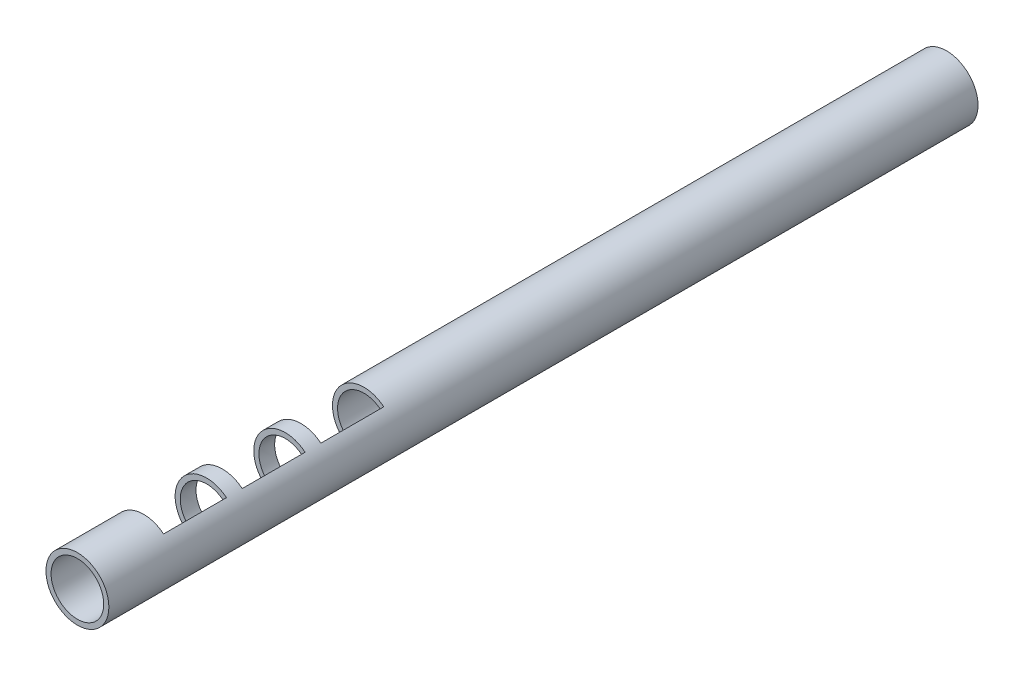
ISO-10303-21;
HEADER;
FILE_DESCRIPTION(('STEP AP214'),'2;1');
FILE_NAME('part.step','',(''),(''),'','','');
FILE_SCHEMA(('AUTOMOTIVE_DESIGN { 1 0 10303 214 1 1 1 1 }'));
ENDSEC;
DATA;
#1=APPLICATION_CONTEXT('core data for automotive mechanical design processes');
#2=APPLICATION_PROTOCOL_DEFINITION('international standard','automotive_design',2000,#1);
#3=PRODUCT_CONTEXT('',#1,'mechanical');
#4=PRODUCT('Part','Part','',(#3));
#5=PRODUCT_RELATED_PRODUCT_CATEGORY('part','',(#4));
#6=PRODUCT_DEFINITION_FORMATION('','',#4);
#7=PRODUCT_DEFINITION_CONTEXT('part definition',#1,'design');
#8=PRODUCT_DEFINITION('design','',#6,#7);
#9=PRODUCT_DEFINITION_SHAPE('','',#8);
#10=(LENGTH_UNIT() NAMED_UNIT(*) SI_UNIT(.MILLI.,.METRE.));
#11=(NAMED_UNIT(*) PLANE_ANGLE_UNIT() SI_UNIT($,.RADIAN.));
#12=(NAMED_UNIT(*) SI_UNIT($,.STERADIAN.) SOLID_ANGLE_UNIT());
#13=UNCERTAINTY_MEASURE_WITH_UNIT(LENGTH_MEASURE(1.E-05),#10,'distance_accuracy_value','');
#14=(GEOMETRIC_REPRESENTATION_CONTEXT(3) GLOBAL_UNCERTAINTY_ASSIGNED_CONTEXT((#13)) GLOBAL_UNIT_ASSIGNED_CONTEXT((#10,
#11,#12)) REPRESENTATION_CONTEXT('',''));
#15=CARTESIAN_POINT('',(0.,0.,0.));
#16=DIRECTION('',(0.,0.,1.));
#17=DIRECTION('',(1.,0.,0.));
#18=AXIS2_PLACEMENT_3D('',#15,#16,#17);
#19=CARTESIAN_POINT('',(0.393200000000001,0.481952030808046,2.488));
#20=DIRECTION('',(-0.774842493260524,0.632154340836013,0.));
#21=DIRECTION('',(0.,0.,1.));
#22=AXIS2_PLACEMENT_3D('',#19,#20,#21);
#23=PLANE('',#22);
#24=DIRECTION('',(0.632154340836013,0.774842493260524,0.));
#25=VECTOR('',#24,1.);
#26=CARTESIAN_POINT('',(0.393200000000001,0.481952030808046,1.866));
#27=LINE('',#26,#25);
#28=CARTESIAN_POINT('',(0.329108400000001,0.403393849786335,1.866));
#29=VERTEX_POINT('',#28);
#30=CARTESIAN_POINT('',(0.393200000000001,0.481952030808046,1.866));
#31=VERTEX_POINT('',#30);
#32=EDGE_CURVE('E11',#29,#31,#27,.T.);
#33=ORIENTED_EDGE('',*,*,#32,.F.);
#34=DIRECTION('',(0.,0.,1.));
#35=VECTOR('',#34,1.);
#36=CARTESIAN_POINT('',(0.329108400000001,0.403393849786335,1.555));
#37=LINE('',#36,#35);
#38=CARTESIAN_POINT('',(0.329108400000001,0.403393849786335,3.11));
#39=VERTEX_POINT('',#38);
#40=EDGE_CURVE('E291',#29,#39,#37,.T.);
#41=ORIENTED_EDGE('',*,*,#40,.T.);
#42=DIRECTION('',(0.632154340836013,0.774842493260524,0.));
#43=VECTOR('',#42,1.);
#44=CARTESIAN_POINT('',(0.393200000000001,0.481952030808046,3.11));
#45=LINE('',#44,#43);
#46=CARTESIAN_POINT('',(0.393200000000001,0.481952030808046,3.11));
#47=VERTEX_POINT('',#46);
#48=EDGE_CURVE('E46',#39,#47,#45,.T.);
#49=ORIENTED_EDGE('',*,*,#48,.T.);
#50=DIRECTION('',(0.,0.,1.));
#51=VECTOR('',#50,1.);
#52=CARTESIAN_POINT('',(0.393200000000001,0.481952030808046,1.555));
#53=LINE('',#52,#51);
#54=EDGE_CURVE('E281',#31,#47,#53,.T.);
#55=ORIENTED_EDGE('',*,*,#54,.F.);
#56=EDGE_LOOP('',(#33,#41,#49,#55));
#57=FACE_BOUND('',#56,.T.);
#58=ADVANCED_FACE('F38',(#57),#23,.T.);
#59=CARTESIAN_POINT('',(0.,0.,3.11));
#60=DIRECTION('',(0.,0.,1.));
#61=DIRECTION('',(1.,0.,0.));
#62=AXIS2_PLACEMENT_3D('',#59,#60,#61);
#63=PLANE('',#62);
#64=ORIENTED_EDGE('',*,*,#48,.F.);
#65=CARTESIAN_POINT('',(0.,0.,3.11));
#66=DIRECTION('',(0.,0.,1.));
#67=DIRECTION('',(1.,0.,0.));
#68=AXIS2_PLACEMENT_3D('',#65,#66,#67);
#69=CIRCLE('',#68,0.520614);
#70=CARTESIAN_POINT('',(0.329108400000001,-0.403393849786335,3.11));
#71=VERTEX_POINT('',#70);
#72=EDGE_CURVE('E288',#39,#71,#69,.T.);
#73=ORIENTED_EDGE('',*,*,#72,.T.);
#74=DIRECTION('',(0.632154340836013,-0.774842493260524,0.));
#75=VECTOR('',#74,1.);
#76=CARTESIAN_POINT('',(0.3932,-0.481952030808046,3.11));
#77=LINE('',#76,#75);
#78=CARTESIAN_POINT('',(0.3932,-0.481952030808046,3.11));
#79=VERTEX_POINT('',#78);
#80=EDGE_CURVE('E171',#71,#79,#77,.T.);
#81=ORIENTED_EDGE('',*,*,#80,.T.);
#82=CARTESIAN_POINT('',(0.,0.,3.11));
#83=DIRECTION('',(0.,0.,-1.));
#84=DIRECTION('',(-1.,0.,0.));
#85=AXIS2_PLACEMENT_3D('',#82,#83,#84);
#86=CIRCLE('',#85,0.622);
#87=EDGE_CURVE('E276',#47,#79,#86,.F.);
#88=ORIENTED_EDGE('',*,*,#87,.F.);
#89=EDGE_LOOP('',(#64,#73,#81,#88));
#90=FACE_BOUND('',#89,.T.);
#91=ADVANCED_FACE('F236',(#90),#63,.F.);
#92=CARTESIAN_POINT('',(0.,0.,3.421));
#93=DIRECTION('',(0.,0.,-1.));
#94=DIRECTION('',(-1.,0.,0.));
#95=AXIS2_PLACEMENT_3D('',#92,#93,#94);
#96=PLANE('',#95);
#97=DIRECTION('',(0.632154340836013,0.774842493260524,0.));
#98=VECTOR('',#97,1.);
#99=CARTESIAN_POINT('',(0.393200000000001,0.481952030808046,3.421));
#100=LINE('',#99,#98);
#101=CARTESIAN_POINT('',(0.329108400000001,0.403393849786335,3.421));
#102=VERTEX_POINT('',#101);
#103=CARTESIAN_POINT('',(0.393200000000001,0.481952030808046,3.421));
#104=VERTEX_POINT('',#103);
#105=EDGE_CURVE('E263',#102,#104,#100,.T.);
#106=ORIENTED_EDGE('',*,*,#105,.T.);
#107=CARTESIAN_POINT('',(0.,0.,3.421));
#108=DIRECTION('',(0.,0.,1.));
#109=DIRECTION('',(1.,0.,0.));
#110=AXIS2_PLACEMENT_3D('',#107,#108,#109);
#111=CIRCLE('',#110,0.622);
#112=CARTESIAN_POINT('',(0.393200000000001,-0.481952030808046,3.421));
#113=VERTEX_POINT('',#112);
#114=EDGE_CURVE('E277',#104,#113,#111,.T.);
#115=ORIENTED_EDGE('',*,*,#114,.T.);
#116=DIRECTION('',(0.632154340836013,-0.774842493260524,0.));
#117=VECTOR('',#116,1.);
#118=CARTESIAN_POINT('',(0.393200000000001,-0.481952030808046,3.421));
#119=LINE('',#118,#117);
#120=CARTESIAN_POINT('',(0.329108400000001,-0.403393849786335,3.421));
#121=VERTEX_POINT('',#120);
#122=EDGE_CURVE('E147',#121,#113,#119,.T.);
#123=ORIENTED_EDGE('',*,*,#122,.F.);
#124=CARTESIAN_POINT('',(0.,0.,3.421));
#125=DIRECTION('',(0.,0.,1.));
#126=DIRECTION('',(1.,0.,0.));
#127=AXIS2_PLACEMENT_3D('',#124,#125,#126);
#128=CIRCLE('',#127,0.520614);
#129=EDGE_CURVE('E274',#102,#121,#128,.T.);
#130=ORIENTED_EDGE('',*,*,#129,.F.);
#131=EDGE_LOOP('',(#106,#115,#123,#130));
#132=FACE_BOUND('',#131,.T.);
#133=ADVANCED_FACE('F241',(#132),#96,.F.);
#134=CARTESIAN_POINT('',(0.,0.,1.555));
#135=DIRECTION('',(0.,0.,-1.));
#136=DIRECTION('',(-1.,0.,0.));
#137=AXIS2_PLACEMENT_3D('',#134,#135,#136);
#138=PLANE('',#137);
#139=DIRECTION('',(0.632154340836013,0.774842493260524,0.));
#140=VECTOR('',#139,1.);
#141=CARTESIAN_POINT('',(0.3932,0.481952030808046,1.555));
#142=LINE('',#141,#140);
#143=CARTESIAN_POINT('',(0.3291084,0.403393849786335,1.555));
#144=VERTEX_POINT('',#143);
#145=CARTESIAN_POINT('',(0.3932,0.481952030808046,1.555));
#146=VERTEX_POINT('',#145);
#147=EDGE_CURVE('E250',#144,#146,#142,.T.);
#148=ORIENTED_EDGE('',*,*,#147,.F.);
#149=CARTESIAN_POINT('',(0.,0.,1.555));
#150=DIRECTION('',(0.,0.,1.));
#151=DIRECTION('',(1.,0.,0.));
#152=AXIS2_PLACEMENT_3D('',#149,#150,#151);
#153=CIRCLE('',#152,0.520614);
#154=CARTESIAN_POINT('',(0.3291084,-0.403393849786335,1.555));
#155=VERTEX_POINT('',#154);
#156=EDGE_CURVE('E252',#144,#155,#153,.T.);
#157=ORIENTED_EDGE('',*,*,#156,.T.);
#158=DIRECTION('',(0.632154340836013,-0.774842493260524,0.));
#159=VECTOR('',#158,1.);
#160=CARTESIAN_POINT('',(0.3932,-0.481952030808046,1.555));
#161=LINE('',#160,#159);
#162=CARTESIAN_POINT('',(0.3932,-0.481952030808046,1.555));
#163=VERTEX_POINT('',#162);
#164=EDGE_CURVE('E160',#155,#163,#161,.T.);
#165=ORIENTED_EDGE('',*,*,#164,.T.);
#166=CARTESIAN_POINT('',(0.,0.,1.555));
#167=DIRECTION('',(0.,0.,1.));
#168=DIRECTION('',(1.,0.,0.));
#169=AXIS2_PLACEMENT_3D('',#166,#167,#168);
#170=CIRCLE('',#169,0.622);
#171=EDGE_CURVE('E61',#146,#163,#170,.T.);
#172=ORIENTED_EDGE('',*,*,#171,.F.);
#173=EDGE_LOOP('',(#148,#157,#165,#172));
#174=FACE_BOUND('',#173,.T.);
#175=ADVANCED_FACE('F232',(#174),#138,.T.);
#176=CARTESIAN_POINT('',(0.,0.,1.866));
#177=DIRECTION('',(0.,0.,-1.));
#178=DIRECTION('',(-1.,0.,0.));
#179=AXIS2_PLACEMENT_3D('',#176,#177,#178);
#180=PLANE('',#179);
#181=CARTESIAN_POINT('',(0.,0.,1.866));
#182=DIRECTION('',(0.,0.,1.));
#183=DIRECTION('',(1.,0.,0.));
#184=AXIS2_PLACEMENT_3D('',#181,#182,#183);
#185=CIRCLE('',#184,0.520614);
#186=CARTESIAN_POINT('',(0.329108400000001,-0.403393849786335,1.866));
#187=VERTEX_POINT('',#186);
#188=EDGE_CURVE('E279',#187,#29,#185,.F.);
#189=ORIENTED_EDGE('',*,*,#188,.T.);
#190=ORIENTED_EDGE('',*,*,#32,.T.);
#191=CARTESIAN_POINT('',(0.,0.,1.866));
#192=DIRECTION('',(0.,0.,1.));
#193=DIRECTION('',(1.,0.,0.));
#194=AXIS2_PLACEMENT_3D('',#191,#192,#193);
#195=CIRCLE('',#194,0.622);
#196=CARTESIAN_POINT('',(0.3932,-0.481952030808046,1.866));
#197=VERTEX_POINT('',#196);
#198=EDGE_CURVE('E284',#197,#31,#195,.F.);
#199=ORIENTED_EDGE('',*,*,#198,.F.);
#200=DIRECTION('',(0.632154340836013,-0.774842493260524,0.));
#201=VECTOR('',#200,1.);
#202=CARTESIAN_POINT('',(0.3932,-0.481952030808046,1.866));
#203=LINE('',#202,#201);
#204=EDGE_CURVE('E176',#187,#197,#203,.T.);
#205=ORIENTED_EDGE('',*,*,#204,.F.);
#206=EDGE_LOOP('',(#189,#190,#199,#205));
#207=FACE_BOUND('',#206,.T.);
#208=ADVANCED_FACE('F40',(#207),#180,.F.);
#209=CARTESIAN_POINT('',(0.,0.,1.555));
#210=DIRECTION('',(0.,0.,1.));
#211=DIRECTION('',(1.,0.,0.));
#212=AXIS2_PLACEMENT_3D('',#209,#210,#211);
#213=CYLINDRICAL_SURFACE('',#212,0.622);
#214=CARTESIAN_POINT('',(-0.622,0.,5.365));
#215=CARTESIAN_POINT('',(-0.621999577929827,0.0109193633288384,5.36499939308507));
#216=CARTESIAN_POINT('',(-0.621709329938002,0.0218502270294628,5.36410161503432));
#217=CARTESIAN_POINT('',(-0.620578112855119,0.043402443202015,5.36054010866013));
#218=CARTESIAN_POINT('',(-0.619736207669612,0.0540232374685384,5.35787337854731));
#219=CARTESIAN_POINT('',(-0.617593869971351,0.0746246518911457,5.35087419082279));
#220=CARTESIAN_POINT('',(-0.61629445041236,0.0846066291781811,5.34654541114978));
#221=CARTESIAN_POINT('',(-0.613370888019472,0.103699386181399,5.33635803819557));
#222=CARTESIAN_POINT('',(-0.61174679129765,0.112810289340036,5.33049966211826));
#223=CARTESIAN_POINT('',(-0.608286102372987,0.130203719158426,5.31721765206123));
#224=CARTESIAN_POINT('',(-0.606444663928166,0.138453985198494,5.30975303528527));
#225=CARTESIAN_POINT('',(-0.602784240920798,0.153610144329198,5.29355730894605));
#226=CARTESIAN_POINT('',(-0.600965262165017,0.160515696300347,5.28482587900247));
#227=CARTESIAN_POINT('',(-0.597503530771228,0.172963818804697,5.26606209326497));
#228=CARTESIAN_POINT('',(-0.595866696764658,0.178465603211153,5.25600148309368));
#229=CARTESIAN_POINT('',(-0.59302745289626,0.187685596399211,5.23503670826931));
#230=CARTESIAN_POINT('',(-0.591824918677886,0.191404315840203,5.22413278617599));
#231=CARTESIAN_POINT('',(-0.590041030843826,0.196833859126492,5.20215455937567));
#232=CARTESIAN_POINT('',(-0.589441214579351,0.198604530142794,5.19109658086054));
#233=CARTESIAN_POINT('',(-0.588875945894283,0.200274737992444,5.16882547613999));
#234=CARTESIAN_POINT('',(-0.588910313539342,0.200174805564169,5.15761239484344));
#235=CARTESIAN_POINT('',(-0.589593281584499,0.198153311328795,5.13585096574481));
#236=CARTESIAN_POINT('',(-0.590215937903085,0.196308688318,5.12529451770902));
#237=CARTESIAN_POINT('',(-0.591963052928186,0.190975230611652,5.10464966713253));
#238=CARTESIAN_POINT('',(-0.593087570309906,0.187486203657547,5.09456131947219));
#239=CARTESIAN_POINT('',(-0.595731017518543,0.178910257031213,5.07495920845102));
#240=CARTESIAN_POINT('',(-0.597255714099061,0.173799725062295,5.06545658672679));
#241=CARTESIAN_POINT('',(-0.600525069528976,0.162142523518303,5.0474194725291));
#242=CARTESIAN_POINT('',(-0.602269776064023,0.155595542374402,5.0388851907008));
#243=CARTESIAN_POINT('',(-0.605885585651293,0.140878299077213,5.02259381155107));
#244=CARTESIAN_POINT('',(-0.607758727443434,0.132645000236177,5.01489400937032));
#245=CARTESIAN_POINT('',(-0.611347152244487,0.114977401877551,5.0009672538188));
#246=CARTESIAN_POINT('',(-0.613062366497891,0.105542583485076,4.9947409401126));
#247=CARTESIAN_POINT('',(-0.616161845004992,0.0856218640392364,4.98389576386483));
#248=CARTESIAN_POINT('',(-0.617542856982662,0.0751269410421367,4.97929251303983));
#249=CARTESIAN_POINT('',(-0.619792686366072,0.0534683769053928,4.9719420636265));
#250=CARTESIAN_POINT('',(-0.620662554643341,0.0423061601262106,4.96919105526121));
#251=CARTESIAN_POINT('',(-0.62148320570485,0.025868383558992,4.96661195013316));
#252=CARTESIAN_POINT('',(-0.621676438455422,0.020715991613797,4.966008193597));
#253=CARTESIAN_POINT('',(-0.621934936052818,0.0103765990587502,4.96520207383045));
#254=CARTESIAN_POINT('',(-0.62200020059546,0.00518959836666256,4.96499971155417));
#255=CARTESIAN_POINT('',(-0.621999577929833,-0.0109193633288352,4.96500060691491));
#256=CARTESIAN_POINT('',(-0.621709329938004,-0.0218502270294587,4.96589838496567));
#257=CARTESIAN_POINT('',(-0.620578112855117,-0.0434024432020111,4.96945989133987));
#258=CARTESIAN_POINT('',(-0.619736207669612,-0.0540232374685353,4.97212662145269));
#259=CARTESIAN_POINT('',(-0.617593869971351,-0.0746246518911438,4.97912580917721));
#260=CARTESIAN_POINT('',(-0.616294450412361,-0.0846066291781794,4.98345458885022));
#261=CARTESIAN_POINT('',(-0.613370888019472,-0.103699386181397,4.99364196180443));
#262=CARTESIAN_POINT('',(-0.611746791297651,-0.112810289340035,4.99950033788174));
#263=CARTESIAN_POINT('',(-0.608286102372988,-0.130203719158423,5.01278234793877));
#264=CARTESIAN_POINT('',(-0.606444663928166,-0.138453985198492,5.02024696471472));
#265=CARTESIAN_POINT('',(-0.602784240920798,-0.153610144329196,5.03644269105395));
#266=CARTESIAN_POINT('',(-0.600965262165017,-0.160515696300345,5.04517412099753));
#267=CARTESIAN_POINT('',(-0.597503530771229,-0.172963818804695,5.06393790673503));
#268=CARTESIAN_POINT('',(-0.595866696764659,-0.178465603211152,5.07399851690632));
#269=CARTESIAN_POINT('',(-0.59302745289626,-0.187685596399211,5.09496329173069));
#270=CARTESIAN_POINT('',(-0.591824918677886,-0.191404315840202,5.10586721382401));
#271=CARTESIAN_POINT('',(-0.590041030843827,-0.196833859126491,5.12784544062432));
#272=CARTESIAN_POINT('',(-0.589441214579351,-0.198604530142794,5.13890341913945));
#273=CARTESIAN_POINT('',(-0.588875945894283,-0.200274737992444,5.16117452386001));
#274=CARTESIAN_POINT('',(-0.588910313539342,-0.200174805564169,5.17238760515656));
#275=CARTESIAN_POINT('',(-0.589593281584499,-0.198153311328795,5.19414903425519));
#276=CARTESIAN_POINT('',(-0.590215937903085,-0.196308688318,5.20470548229097));
#277=CARTESIAN_POINT('',(-0.591963052928186,-0.190975230611653,5.22535033286746));
#278=CARTESIAN_POINT('',(-0.593087570309906,-0.187486203657547,5.2354386805278));
#279=CARTESIAN_POINT('',(-0.595731017518542,-0.178910257031214,5.25504079154898));
#280=CARTESIAN_POINT('',(-0.597255714099061,-0.173799725062295,5.26454341327321));
#281=CARTESIAN_POINT('',(-0.600525069528976,-0.162142523518304,5.2825805274709));
#282=CARTESIAN_POINT('',(-0.602269776064022,-0.155595542374403,5.29111480929919));
#283=CARTESIAN_POINT('',(-0.605885585651293,-0.140878299077215,5.30740618844893));
#284=CARTESIAN_POINT('',(-0.607758727443433,-0.132645000236179,5.31510599062967));
#285=CARTESIAN_POINT('',(-0.611347152244487,-0.114977401877553,5.3290327461812));
#286=CARTESIAN_POINT('',(-0.61306236649789,-0.105542583485078,5.3352590598874));
#287=CARTESIAN_POINT('',(-0.616161845004992,-0.0856218640392379,5.34610423613517));
#288=CARTESIAN_POINT('',(-0.617542856982662,-0.0751269410421379,5.35070748696017));
#289=CARTESIAN_POINT('',(-0.619792686366072,-0.0534683769053939,5.3580579363735));
#290=CARTESIAN_POINT('',(-0.62066255464334,-0.042306160126212,5.36080894473879));
#291=CARTESIAN_POINT('',(-0.62148320570485,-0.0258683835589934,5.36338804986684));
#292=CARTESIAN_POINT('',(-0.621676438455423,-0.0207159916137979,5.363991806403));
#293=CARTESIAN_POINT('',(-0.621934936052818,-0.0103765990587498,5.36479792616955));
#294=CARTESIAN_POINT('',(-0.622000200595457,-0.00518959836666111,5.36500028844582));
#295=CARTESIAN_POINT('',(-0.622,0.,5.365));
#296=B_SPLINE_CURVE_WITH_KNOTS('',3,(#214,#215,#216,#217,#218,#219,#220,#221,#222,#223,#224,
#225,#226,#227,#228,#229,#230,#231,#232,#233,#234,#235,#236,#237,#238,#239,#240,#241,#242,#243,
#244,#245,#246,#247,#248,#249,#250,#251,#252,#253,#254,#255,#256,#257,#258,#259,#260,#261,#262,
#263,#264,#265,#266,#267,#268,#269,#270,#271,#272,#273,#274,#275,#276,#277,#278,#279,#280,#281,
#282,#283,#284,#285,#286,#287,#288,#289,#290,#291,#292,#293,#294,#295),.UNSPECIFIED.,.T.,.F.,(4,
2,2,2,2,2,2,2,2,2,2,2,2,2,2,2,2,2,2,2,2,2,2,2,2,2,2,2,2,2,2,2,2,2,2,2,2,2,2,2,4),(0.,
0.0327380856553519,0.065531868183564,0.0982534959600799,0.130970479764623,0.16465009229773,
0.198338237386977,0.232915564706205,0.26748298335722,0.300955906343576,0.334419332343535,
0.366472648404575,0.398529712968828,0.431076848275395,0.463631050114923,0.497754520395143,
0.531892777149168,0.566350973681965,0.600738076718819,0.61629732746276,0.631856615191184,
0.664594700846535,0.697388483374749,0.730110111151266,0.762827094955808,0.796506707488914,
0.830194852578161,0.864772179897391,0.899339598548406,0.932812521534762,0.96627594753472,
0.998329263595761,1.03038632816001,1.06293346346658,1.09548766530611,1.12961113558633,
1.16374939234035,1.19820758887315,1.23259469191,1.24815394265395,1.26371323038237),.UNSPECIFIED.);
#297=CARTESIAN_POINT('',(-0.622,0.,5.365));
#298=VERTEX_POINT('',#297);
#299=EDGE_CURVE('E186',#298,#298,#296,.T.);
#300=ORIENTED_EDGE('',*,*,#299,.F.);
#301=EDGE_LOOP('',(#300));
#302=FACE_BOUND('',#301,.T.);
#303=DIRECTION('',(0.,0.,1.));
#304=VECTOR('',#303,1.);
#305=CARTESIAN_POINT('',(0.393200000000001,-0.481952030808046,3.11));
#306=LINE('',#305,#304);
#307=CARTESIAN_POINT('',(0.393200000000001,-0.481952030808046,4.665));
#308=VERTEX_POINT('',#307);
#309=EDGE_CURVE('E135',#113,#308,#306,.T.);
#310=ORIENTED_EDGE('',*,*,#309,.F.);
#311=ORIENTED_EDGE('',*,*,#114,.F.);
#312=DIRECTION('',(0.,0.,1.));
#313=VECTOR('',#312,1.);
#314=CARTESIAN_POINT('',(0.393200000000001,0.481952030808046,3.11));
#315=LINE('',#314,#313);
#316=CARTESIAN_POINT('',(0.393200000000001,0.481952030808046,4.665));
#317=VERTEX_POINT('',#316);
#318=EDGE_CURVE('E137',#104,#317,#315,.T.);
#319=ORIENTED_EDGE('',*,*,#318,.T.);
#320=CARTESIAN_POINT('',(0.,0.,4.665));
#321=DIRECTION('',(0.,0.,-1.));
#322=DIRECTION('',(-1.,0.,0.));
#323=AXIS2_PLACEMENT_3D('',#320,#321,#322);
#324=CIRCLE('',#323,0.622);
#325=EDGE_CURVE('E129',#317,#308,#324,.F.);
#326=ORIENTED_EDGE('',*,*,#325,.T.);
#327=EDGE_LOOP('',(#310,#311,#319,#326));
#328=FACE_BOUND('',#327,.T.);
#329=CARTESIAN_POINT('',(0.,0.,5.976));
#330=DIRECTION('',(0.,0.,1.));
#331=DIRECTION('',(1.,0.,0.));
#332=AXIS2_PLACEMENT_3D('',#329,#330,#331);
#333=CIRCLE('',#332,0.622);
#334=CARTESIAN_POINT('',(0.622,0.,5.976));
#335=VERTEX_POINT('',#334);
#336=EDGE_CURVE('E527',#335,#335,#333,.T.);
#337=ORIENTED_EDGE('',*,*,#336,.F.);
#338=EDGE_LOOP('',(#337));
#339=FACE_BOUND('',#338,.T.);
#340=DIRECTION('',(0.,0.,1.));
#341=VECTOR('',#340,1.);
#342=CARTESIAN_POINT('',(0.3932,-0.481952030808046,1.555));
#343=LINE('',#342,#341);
#344=EDGE_CURVE('E168',#197,#79,#343,.T.);
#345=ORIENTED_EDGE('',*,*,#344,.F.);
#346=ORIENTED_EDGE('',*,*,#198,.T.);
#347=ORIENTED_EDGE('',*,*,#54,.T.);
#348=ORIENTED_EDGE('',*,*,#87,.T.);
#349=EDGE_LOOP('',(#345,#346,#347,#348));
#350=FACE_BOUND('',#349,.T.);
#351=DIRECTION('',(0.,0.,1.));
#352=VECTOR('',#351,1.);
#353=CARTESIAN_POINT('',(0.3932,-0.481952030808046,0.));
#354=LINE('',#353,#352);
#355=CARTESIAN_POINT('',(0.3932,-0.481952030808046,0.311));
#356=VERTEX_POINT('',#355);
#357=EDGE_CURVE('E157',#356,#163,#354,.T.);
#358=ORIENTED_EDGE('',*,*,#357,.F.);
#359=CARTESIAN_POINT('',(0.,0.,0.311));
#360=DIRECTION('',(0.,0.,1.));
#361=DIRECTION('',(1.,0.,0.));
#362=AXIS2_PLACEMENT_3D('',#359,#360,#361);
#363=CIRCLE('',#362,0.622);
#364=CARTESIAN_POINT('',(0.3932,0.481952030808046,0.311));
#365=VERTEX_POINT('',#364);
#366=EDGE_CURVE('E256',#356,#365,#363,.F.);
#367=ORIENTED_EDGE('',*,*,#366,.T.);
#368=DIRECTION('',(0.,0.,1.));
#369=VECTOR('',#368,1.);
#370=CARTESIAN_POINT('',(0.3932,0.481952030808046,0.));
#371=LINE('',#370,#369);
#372=EDGE_CURVE('E265',#365,#146,#371,.T.);
#373=ORIENTED_EDGE('',*,*,#372,.T.);
#374=ORIENTED_EDGE('',*,*,#171,.T.);
#375=EDGE_LOOP('',(#358,#367,#373,#374));
#376=FACE_BOUND('',#375,.T.);
#377=CARTESIAN_POINT('',(0.,0.,-11.21));
#378=DIRECTION('',(0.,0.,-1.));
#379=DIRECTION('',(-1.,0.,0.));
#380=AXIS2_PLACEMENT_3D('',#377,#378,#379);
#381=CIRCLE('',#380,0.622);
#382=CARTESIAN_POINT('',(-0.622,0.,-11.21));
#383=VERTEX_POINT('',#382);
#384=EDGE_CURVE('E312',#383,#383,#381,.T.);
#385=ORIENTED_EDGE('',*,*,#384,.F.);
#386=EDGE_LOOP('',(#385));
#387=FACE_BOUND('',#386,.T.);
#388=ADVANCED_FACE('F131',(#302,#328,#339,#350,#376,#387),#213,.T.);
#389=CARTESIAN_POINT('',(0.,0.,1.555));
#390=DIRECTION('',(0.,0.,1.));
#391=DIRECTION('',(1.,0.,0.));
#392=AXIS2_PLACEMENT_3D('',#389,#390,#391);
#393=CYLINDRICAL_SURFACE('',#392,0.520614);
#394=CARTESIAN_POINT('',(-0.520614,0.,5.365));
#395=CARTESIAN_POINT('',(-0.520613514689114,0.0107956701120088,5.36499937381276));
#396=CARTESIAN_POINT('',(-0.520274634314804,0.0216012044258958,5.36412169078187));
#397=CARTESIAN_POINT('',(-0.518953603242681,0.0429001093390013,5.36064353234449));
#398=CARTESIAN_POINT('',(-0.517970491559685,0.0533929890741568,5.35804048318187));
#399=CARTESIAN_POINT('',(-0.515467170996156,0.073738227431799,5.35121886699427));
#400=CARTESIAN_POINT('',(-0.513948400366225,0.0835922184170895,5.34700462352429));
#401=CARTESIAN_POINT('',(-0.510524407794475,0.102448673096472,5.3370981675949));
#402=CARTESIAN_POINT('',(-0.508619200560733,0.111451169180001,5.33140601138369));
#403=CARTESIAN_POINT('',(-0.504523374923857,0.128752900072885,5.3184411156542));
#404=CARTESIAN_POINT('',(-0.502324385367266,0.137009567903274,5.31111423454273));
#405=CARTESIAN_POINT('',(-0.497928940551434,0.152211856034186,5.29520255463404));
#406=CARTESIAN_POINT('',(-0.495732486539278,0.159156987475636,5.2866172888989));
#407=CARTESIAN_POINT('',(-0.4914925845933,0.171815042363857,5.26801064474767));
#408=CARTESIAN_POINT('',(-0.489458890180966,0.177466918989746,5.2579452888811));
#409=CARTESIAN_POINT('',(-0.485905241196104,0.186978631328273,5.23691659564903));
#410=CARTESIAN_POINT('',(-0.484385069683624,0.190839224034607,5.22595363991631));
#411=CARTESIAN_POINT('',(-0.482120130764399,0.196489388722503,5.203930258725));
#412=CARTESIAN_POINT('',(-0.481345075675259,0.198360218476035,5.19289390331718));
#413=CARTESIAN_POINT('',(-0.480569780928279,0.200231751889377,5.17063878623134));
#414=CARTESIAN_POINT('',(-0.480569199721745,0.200233279925004,5.1594201071423));
#415=CARTESIAN_POINT('',(-0.481316904110774,0.198428100816448,5.13787534382539));
#416=CARTESIAN_POINT('',(-0.482017784666322,0.196735858737025,5.12753771324575));
#417=CARTESIAN_POINT('',(-0.484010379390151,0.191780980630058,5.10730628041781));
#418=CARTESIAN_POINT('',(-0.485302189169174,0.188518090471457,5.09741255027597));
#419=CARTESIAN_POINT('',(-0.488358502567815,0.180454276834374,5.07812245420864));
#420=CARTESIAN_POINT('',(-0.490131736000886,0.175624590747233,5.06873955628492));
#421=CARTESIAN_POINT('',(-0.493948271745926,0.164584589481138,5.05088526995001));
#422=CARTESIAN_POINT('',(-0.495991658494738,0.158373842233772,5.04241416803002));
#423=CARTESIAN_POINT('',(-0.500294452493576,0.144231468047008,5.02599345908577));
#424=CARTESIAN_POINT('',(-0.502558920556002,0.136209242537718,5.018123017015));
#425=CARTESIAN_POINT('',(-0.506925822119937,0.118930527519278,5.00381254534915));
#426=CARTESIAN_POINT('',(-0.509028179284183,0.109673462063507,4.99737318699076));
#427=CARTESIAN_POINT('',(-0.512879961730973,0.0899750494078043,4.98601390020554));
#428=CARTESIAN_POINT('',(-0.51462252956897,0.0795157371428972,4.98112268638634));
#429=CARTESIAN_POINT('',(-0.51750471262191,0.0578491298274882,4.97320339231079));
#430=CARTESIAN_POINT('',(-0.518645543355978,0.0466433945676833,4.97017155405159));
#431=CARTESIAN_POINT('',(-0.519813743081124,0.029441167770076,4.96709050817924));
#432=CARTESIAN_POINT('',(-0.520112792421215,0.0235854149281415,4.9663077511314));
#433=CARTESIAN_POINT('',(-0.520513053270645,0.0118207605769446,4.96526232687946));
#434=CARTESIAN_POINT('',(-0.520614265763031,0.00591185933192195,4.96499965709107));
#435=CARTESIAN_POINT('',(-0.520613514689164,-0.010795670111983,4.96500062618711));
#436=CARTESIAN_POINT('',(-0.520274634314819,-0.0216012044258642,4.96587830921809));
#437=CARTESIAN_POINT('',(-0.51895360324267,-0.0429001093389702,4.96935646765554));
#438=CARTESIAN_POINT('',(-0.517970491559684,-0.0533929890741318,4.97195951681814));
#439=CARTESIAN_POINT('',(-0.515467170996162,-0.0737382274317821,4.97878113300571));
#440=CARTESIAN_POINT('',(-0.513948400366228,-0.0835922184170746,4.9829953764757));
#441=CARTESIAN_POINT('',(-0.510524407794477,-0.102448673096457,4.99290183240509));
#442=CARTESIAN_POINT('',(-0.508619200560736,-0.111451169179985,4.9985939886163));
#443=CARTESIAN_POINT('',(-0.504523374923862,-0.128752900072867,5.01155888434579));
#444=CARTESIAN_POINT('',(-0.502324385367271,-0.137009567903256,5.01888576545725));
#445=CARTESIAN_POINT('',(-0.497928940551438,-0.15221185603417,5.03479744536594));
#446=CARTESIAN_POINT('',(-0.495732486539283,-0.159156987475622,5.04338271110108));
#447=CARTESIAN_POINT('',(-0.491492584593304,-0.171815042363845,5.06198935525231));
#448=CARTESIAN_POINT('',(-0.48945889018097,-0.177466918989735,5.07205471111888));
#449=CARTESIAN_POINT('',(-0.485905241196107,-0.186978631328265,5.09308340435095));
#450=CARTESIAN_POINT('',(-0.484385069683627,-0.1908392240346,5.10404636008366));
#451=CARTESIAN_POINT('',(-0.482120130764401,-0.196489388722499,5.12606974127498));
#452=CARTESIAN_POINT('',(-0.481345075675261,-0.198360218476032,5.1371060966828));
#453=CARTESIAN_POINT('',(-0.480569780928279,-0.200231751889377,5.15936121376863));
#454=CARTESIAN_POINT('',(-0.480569199721745,-0.200233279925005,5.17057989285767));
#455=CARTESIAN_POINT('',(-0.481316904110773,-0.198428100816451,5.19212465617458));
#456=CARTESIAN_POINT('',(-0.48201778466632,-0.196735858737029,5.20246228675423));
#457=CARTESIAN_POINT('',(-0.484010379390149,-0.191780980630064,5.22269371958216));
#458=CARTESIAN_POINT('',(-0.485302189169171,-0.188518090471464,5.23258744972401));
#459=CARTESIAN_POINT('',(-0.488358502567812,-0.180454276834382,5.25187754579134));
#460=CARTESIAN_POINT('',(-0.490131736000883,-0.175624590747242,5.26126044371506));
#461=CARTESIAN_POINT('',(-0.493948271745923,-0.164584589481149,5.27911473004997));
#462=CARTESIAN_POINT('',(-0.495991658494734,-0.158373842233784,5.28758583196996));
#463=CARTESIAN_POINT('',(-0.500294452493571,-0.144231468047023,5.30400654091421));
#464=CARTESIAN_POINT('',(-0.502558920555997,-0.136209242537736,5.31187698298498));
#465=CARTESIAN_POINT('',(-0.506925822119932,-0.118930527519299,5.32618745465084));
#466=CARTESIAN_POINT('',(-0.509028179284178,-0.109673462063528,5.33262681300923));
#467=CARTESIAN_POINT('',(-0.512879961730971,-0.0899750494078233,5.34398609979445));
#468=CARTESIAN_POINT('',(-0.514622529568969,-0.0795157371429141,5.34887731361366));
#469=CARTESIAN_POINT('',(-0.517504712621907,-0.0578491298275051,5.3567966076892));
#470=CARTESIAN_POINT('',(-0.518645543355971,-0.0466433945677026,5.35982844594839));
#471=CARTESIAN_POINT('',(-0.519813743081125,-0.0294411677700941,5.36290949182077));
#472=CARTESIAN_POINT('',(-0.520112792421223,-0.023585414928155,5.36369224886862));
#473=CARTESIAN_POINT('',(-0.520513053270637,-0.011820760576944,5.36473767312052));
#474=CARTESIAN_POINT('',(-0.520614265763001,-0.00591185933191171,5.36500034290886));
#475=CARTESIAN_POINT('',(-0.520614,0.,5.365));
#476=B_SPLINE_CURVE_WITH_KNOTS('',3,(#394,#395,#396,#397,#398,#399,#400,#401,#402,#403,#404,
#405,#406,#407,#408,#409,#410,#411,#412,#413,#414,#415,#416,#417,#418,#419,#420,#421,#422,#423,
#424,#425,#426,#427,#428,#429,#430,#431,#432,#433,#434,#435,#436,#437,#438,#439,#440,#441,#442,
#443,#444,#445,#446,#447,#448,#449,#450,#451,#452,#453,#454,#455,#456,#457,#458,#459,#460,#461,
#462,#463,#464,#465,#466,#467,#468,#469,#470,#471,#472,#473,#474,#475),.UNSPECIFIED.,.T.,.F.,(4,
2,2,2,2,2,2,2,2,2,2,2,2,2,2,2,2,2,2,2,2,2,2,2,2,2,2,2,2,2,2,2,2,2,2,2,2,2,2,2,4),(0.,
0.0323640931706411,0.064776573354208,0.0971026799981974,0.129427556516403,0.163046166797803,
0.196677283375778,0.231665785134983,0.266639487312473,0.300122540074218,0.333590826557912,
0.364940387240171,0.396295021991102,0.428261331555217,0.460237655964198,0.494473823824758,
0.528726016113178,0.563580615113041,0.598364534951794,0.616087651254464,0.633810679491186,
0.666174772661821,0.698587252845402,0.730913359489398,0.763238236007596,0.796856846288992,
0.83048796286697,0.865476464626175,0.900450166803664,0.93393321956541,0.967401506049105,
0.998751066731365,1.0301057014823,1.06207201104641,1.09404833545539,1.12828450331595,
1.16253669560437,1.19739129460424,1.23217521444299,1.24989833074567,1.26762135898242),.UNSPECIFIED.);
#477=CARTESIAN_POINT('',(-0.520614,0.,5.365));
#478=VERTEX_POINT('',#477);
#479=EDGE_CURVE('E179',#478,#478,#476,.T.);
#480=ORIENTED_EDGE('',*,*,#479,.T.);
#481=EDGE_LOOP('',(#480));
#482=FACE_BOUND('',#481,.T.);
#483=ORIENTED_EDGE('',*,*,#129,.T.);
#484=DIRECTION('',(0.,0.,1.));
#485=VECTOR('',#484,1.);
#486=CARTESIAN_POINT('',(0.329108400000001,-0.403393849786335,3.11));
#487=LINE('',#486,#485);
#488=CARTESIAN_POINT('',(0.329108400000001,-0.403393849786335,4.665));
#489=VERTEX_POINT('',#488);
#490=EDGE_CURVE('E151',#121,#489,#487,.T.);
#491=ORIENTED_EDGE('',*,*,#490,.T.);
#492=CARTESIAN_POINT('',(0.,0.,4.665));
#493=DIRECTION('',(0.,0.,1.));
#494=DIRECTION('',(1.,0.,0.));
#495=AXIS2_PLACEMENT_3D('',#492,#493,#494);
#496=CIRCLE('',#495,0.520614);
#497=CARTESIAN_POINT('',(0.329108400000001,0.403393849786335,4.665));
#498=VERTEX_POINT('',#497);
#499=EDGE_CURVE('E143',#498,#489,#496,.T.);
#500=ORIENTED_EDGE('',*,*,#499,.F.);
#501=DIRECTION('',(0.,0.,1.));
#502=VECTOR('',#501,1.);
#503=CARTESIAN_POINT('',(0.329108400000001,0.403393849786335,3.11));
#504=LINE('',#503,#502);
#505=EDGE_CURVE('E53',#102,#498,#504,.T.);
#506=ORIENTED_EDGE('',*,*,#505,.F.);
#507=EDGE_LOOP('',(#483,#491,#500,#506));
#508=FACE_BOUND('',#507,.T.);
#509=CARTESIAN_POINT('',(0.,0.,5.976));
#510=DIRECTION('',(0.,0.,-1.));
#511=DIRECTION('',(1.,0.,0.));
#512=AXIS2_PLACEMENT_3D('',#509,#510,#511);
#513=CIRCLE('',#512,0.520614);
#514=CARTESIAN_POINT('',(0.520614,0.,5.976));
#515=VERTEX_POINT('',#514);
#516=EDGE_CURVE('E316',#515,#515,#513,.T.);
#517=ORIENTED_EDGE('',*,*,#516,.F.);
#518=EDGE_LOOP('',(#517));
#519=FACE_BOUND('',#518,.T.);
#520=ORIENTED_EDGE('',*,*,#188,.F.);
#521=DIRECTION('',(0.,0.,1.));
#522=VECTOR('',#521,1.);
#523=CARTESIAN_POINT('',(0.329108400000001,-0.403393849786335,1.555));
#524=LINE('',#523,#522);
#525=EDGE_CURVE('E167',#187,#71,#524,.T.);
#526=ORIENTED_EDGE('',*,*,#525,.T.);
#527=ORIENTED_EDGE('',*,*,#72,.F.);
#528=ORIENTED_EDGE('',*,*,#40,.F.);
#529=EDGE_LOOP('',(#520,#526,#527,#528));
#530=FACE_BOUND('',#529,.T.);
#531=CARTESIAN_POINT('',(0.,0.,0.311));
#532=DIRECTION('',(0.,0.,1.));
#533=DIRECTION('',(1.,0.,0.));
#534=AXIS2_PLACEMENT_3D('',#531,#532,#533);
#535=CIRCLE('',#534,0.520614);
#536=CARTESIAN_POINT('',(0.3291084,-0.403393849786335,0.311));
#537=VERTEX_POINT('',#536);
#538=CARTESIAN_POINT('',(0.3291084,0.403393849786335,0.311));
#539=VERTEX_POINT('',#538);
#540=EDGE_CURVE('E262',#537,#539,#535,.F.);
#541=ORIENTED_EDGE('',*,*,#540,.F.);
#542=DIRECTION('',(0.,0.,1.));
#543=VECTOR('',#542,1.);
#544=CARTESIAN_POINT('',(0.3291084,-0.403393849786335,0.));
#545=LINE('',#544,#543);
#546=EDGE_CURVE('E156',#537,#155,#545,.T.);
#547=ORIENTED_EDGE('',*,*,#546,.T.);
#548=ORIENTED_EDGE('',*,*,#156,.F.);
#549=DIRECTION('',(0.,0.,1.));
#550=VECTOR('',#549,1.);
#551=CARTESIAN_POINT('',(0.3291084,0.403393849786335,0.));
#552=LINE('',#551,#550);
#553=EDGE_CURVE('E259',#539,#144,#552,.T.);
#554=ORIENTED_EDGE('',*,*,#553,.F.);
#555=EDGE_LOOP('',(#541,#547,#548,#554));
#556=FACE_BOUND('',#555,.T.);
#557=CARTESIAN_POINT('',(0.,0.,-11.21));
#558=DIRECTION('',(0.,0.,1.));
#559=DIRECTION('',(-1.,0.,0.));
#560=AXIS2_PLACEMENT_3D('',#557,#558,#559);
#561=CIRCLE('',#560,0.520614);
#562=CARTESIAN_POINT('',(-0.520614,0.,-11.21));
#563=VERTEX_POINT('',#562);
#564=EDGE_CURVE('E311',#563,#563,#561,.T.);
#565=ORIENTED_EDGE('',*,*,#564,.F.);
#566=EDGE_LOOP('',(#565));
#567=FACE_BOUND('',#566,.T.);
#568=ADVANCED_FACE('F191',(#482,#508,#519,#530,#556,#567),#393,.F.);
#569=CARTESIAN_POINT('',(0.3932,0.481952030808046,0.933));
#570=DIRECTION('',(-0.774842493260524,0.632154340836013,0.));
#571=DIRECTION('',(0.,0.,1.));
#572=AXIS2_PLACEMENT_3D('',#569,#570,#571);
#573=PLANE('',#572);
#574=DIRECTION('',(0.632154340836013,0.774842493260524,0.));
#575=VECTOR('',#574,1.);
#576=CARTESIAN_POINT('',(0.3932,0.481952030808046,0.311));
#577=LINE('',#576,#575);
#578=EDGE_CURVE('E255',#539,#365,#577,.T.);
#579=ORIENTED_EDGE('',*,*,#578,.F.);
#580=ORIENTED_EDGE('',*,*,#553,.T.);
#581=ORIENTED_EDGE('',*,*,#147,.T.);
#582=ORIENTED_EDGE('',*,*,#372,.F.);
#583=EDGE_LOOP('',(#579,#580,#581,#582));
#584=FACE_BOUND('',#583,.T.);
#585=ADVANCED_FACE('F218',(#584),#573,.T.);
#586=CARTESIAN_POINT('',(0.,0.,0.311));
#587=DIRECTION('',(0.,0.,-1.));
#588=DIRECTION('',(-1.,0.,0.));
#589=AXIS2_PLACEMENT_3D('',#586,#587,#588);
#590=PLANE('',#589);
#591=ORIENTED_EDGE('',*,*,#540,.T.);
#592=ORIENTED_EDGE('',*,*,#578,.T.);
#593=ORIENTED_EDGE('',*,*,#366,.F.);
#594=DIRECTION('',(0.632154340836013,-0.774842493260524,0.));
#595=VECTOR('',#594,1.);
#596=CARTESIAN_POINT('',(0.3932,-0.481952030808046,0.311));
#597=LINE('',#596,#595);
#598=EDGE_CURVE('E164',#537,#356,#597,.T.);
#599=ORIENTED_EDGE('',*,*,#598,.F.);
#600=EDGE_LOOP('',(#591,#592,#593,#599));
#601=FACE_BOUND('',#600,.T.);
#602=ADVANCED_FACE('F216',(#601),#590,.F.);
#603=CARTESIAN_POINT('',(0.393200000000001,0.481952030808046,4.043));
#604=DIRECTION('',(-0.774842493260524,0.632154340836013,0.));
#605=DIRECTION('',(0.,0.,1.));
#606=AXIS2_PLACEMENT_3D('',#603,#604,#605);
#607=PLANE('',#606);
#608=ORIENTED_EDGE('',*,*,#105,.F.);
#609=ORIENTED_EDGE('',*,*,#505,.T.);
#610=DIRECTION('',(0.632154340836013,0.774842493260524,0.));
#611=VECTOR('',#610,1.);
#612=CARTESIAN_POINT('',(0.393200000000001,0.481952030808046,4.665));
#613=LINE('',#612,#611);
#614=EDGE_CURVE('E268',#498,#317,#613,.T.);
#615=ORIENTED_EDGE('',*,*,#614,.T.);
#616=ORIENTED_EDGE('',*,*,#318,.F.);
#617=EDGE_LOOP('',(#608,#609,#615,#616));
#618=FACE_BOUND('',#617,.T.);
#619=ADVANCED_FACE('F213',(#618),#607,.T.);
#620=CARTESIAN_POINT('',(0.,0.,4.665));
#621=DIRECTION('',(0.,0.,1.));
#622=DIRECTION('',(1.,0.,0.));
#623=AXIS2_PLACEMENT_3D('',#620,#621,#622);
#624=PLANE('',#623);
#625=ORIENTED_EDGE('',*,*,#614,.F.);
#626=ORIENTED_EDGE('',*,*,#499,.T.);
#627=DIRECTION('',(0.632154340836013,-0.774842493260524,0.));
#628=VECTOR('',#627,1.);
#629=CARTESIAN_POINT('',(0.393200000000001,-0.481952030808046,4.665));
#630=LINE('',#629,#628);
#631=EDGE_CURVE('E141',#489,#308,#630,.T.);
#632=ORIENTED_EDGE('',*,*,#631,.T.);
#633=ORIENTED_EDGE('',*,*,#325,.F.);
#634=EDGE_LOOP('',(#625,#626,#632,#633));
#635=FACE_BOUND('',#634,.T.);
#636=ADVANCED_FACE('F142',(#635),#624,.F.);
#637=CARTESIAN_POINT('',(0.,0.,-11.21));
#638=DIRECTION('',(0.,0.,-1.));
#639=DIRECTION('',(-1.,0.,0.));
#640=AXIS2_PLACEMENT_3D('',#637,#638,#639);
#641=PLANE('',#640);
#642=ORIENTED_EDGE('',*,*,#564,.T.);
#643=EDGE_LOOP('',(#642));
#644=FACE_BOUND('',#643,.T.);
#645=ORIENTED_EDGE('',*,*,#384,.T.);
#646=EDGE_LOOP('',(#645));
#647=FACE_BOUND('',#646,.T.);
#648=ADVANCED_FACE('F206',(#644,#647),#641,.T.);
#649=CARTESIAN_POINT('',(0.,0.,5.976));
#650=DIRECTION('',(0.,0.,1.));
#651=DIRECTION('',(1.,0.,0.));
#652=AXIS2_PLACEMENT_3D('',#649,#650,#651);
#653=PLANE('',#652);
#654=ORIENTED_EDGE('',*,*,#336,.T.);
#655=EDGE_LOOP('',(#654));
#656=FACE_BOUND('',#655,.T.);
#657=ORIENTED_EDGE('',*,*,#516,.T.);
#658=EDGE_LOOP('',(#657));
#659=FACE_BOUND('',#658,.T.);
#660=ADVANCED_FACE('F200',(#656,#659),#653,.T.);
#661=CARTESIAN_POINT('',(-0.622,0.,5.165));
#662=DIRECTION('',(1.,0.,0.));
#663=DIRECTION('',(0.,0.,-1.));
#664=AXIS2_PLACEMENT_3D('',#661,#662,#663);
#665=CYLINDRICAL_SURFACE('',#664,0.2);
#666=ORIENTED_EDGE('',*,*,#479,.F.);
#667=EDGE_LOOP('',(#666));
#668=FACE_BOUND('',#667,.T.);
#669=ORIENTED_EDGE('',*,*,#299,.T.);
#670=EDGE_LOOP('',(#669));
#671=FACE_BOUND('',#670,.T.);
#672=ADVANCED_FACE('F194',(#668,#671),#665,.F.);
#673=CARTESIAN_POINT('',(0.3932,-0.481952030808046,2.488));
#674=DIRECTION('',(-0.774842493260524,-0.632154340836013,0.));
#675=DIRECTION('',(0.,0.,1.));
#676=AXIS2_PLACEMENT_3D('',#673,#674,#675);
#677=PLANE('',#676);
#678=ORIENTED_EDGE('',*,*,#204,.T.);
#679=ORIENTED_EDGE('',*,*,#344,.T.);
#680=ORIENTED_EDGE('',*,*,#80,.F.);
#681=ORIENTED_EDGE('',*,*,#525,.F.);
#682=EDGE_LOOP('',(#678,#679,#680,#681));
#683=FACE_BOUND('',#682,.T.);
#684=ADVANCED_FACE('F199',(#683),#677,.T.);
#685=CARTESIAN_POINT('',(0.3932,-0.481952030808046,0.933));
#686=DIRECTION('',(-0.774842493260524,-0.632154340836013,0.));
#687=DIRECTION('',(0.,0.,1.));
#688=AXIS2_PLACEMENT_3D('',#685,#686,#687);
#689=PLANE('',#688);
#690=ORIENTED_EDGE('',*,*,#598,.T.);
#691=ORIENTED_EDGE('',*,*,#357,.T.);
#692=ORIENTED_EDGE('',*,*,#164,.F.);
#693=ORIENTED_EDGE('',*,*,#546,.F.);
#694=EDGE_LOOP('',(#690,#691,#692,#693));
#695=FACE_BOUND('',#694,.T.);
#696=ADVANCED_FACE('F327',(#695),#689,.T.);
#697=CARTESIAN_POINT('',(0.393200000000001,-0.481952030808046,4.043));
#698=DIRECTION('',(-0.774842493260524,-0.632154340836013,0.));
#699=DIRECTION('',(0.,0.,1.));
#700=AXIS2_PLACEMENT_3D('',#697,#698,#699);
#701=PLANE('',#700);
#702=ORIENTED_EDGE('',*,*,#122,.T.);
#703=ORIENTED_EDGE('',*,*,#309,.T.);
#704=ORIENTED_EDGE('',*,*,#631,.F.);
#705=ORIENTED_EDGE('',*,*,#490,.F.);
#706=EDGE_LOOP('',(#702,#703,#704,#705));
#707=FACE_BOUND('',#706,.T.);
#708=ADVANCED_FACE('F149',(#707),#701,.T.);
#709=CLOSED_SHELL('',(#58,#91,#133,#175,#208,#388,#568,#585,#602,#619,#636,#648,#660,#672,#684,
#696,#708));
#710=MANIFOLD_SOLID_BREP('B2',#709);
#711=ADVANCED_BREP_SHAPE_REPRESENTATION('',(#18,#710),#14);
#712=SHAPE_DEFINITION_REPRESENTATION(#9,#711);
ENDSEC;
END-ISO-10303-21;
